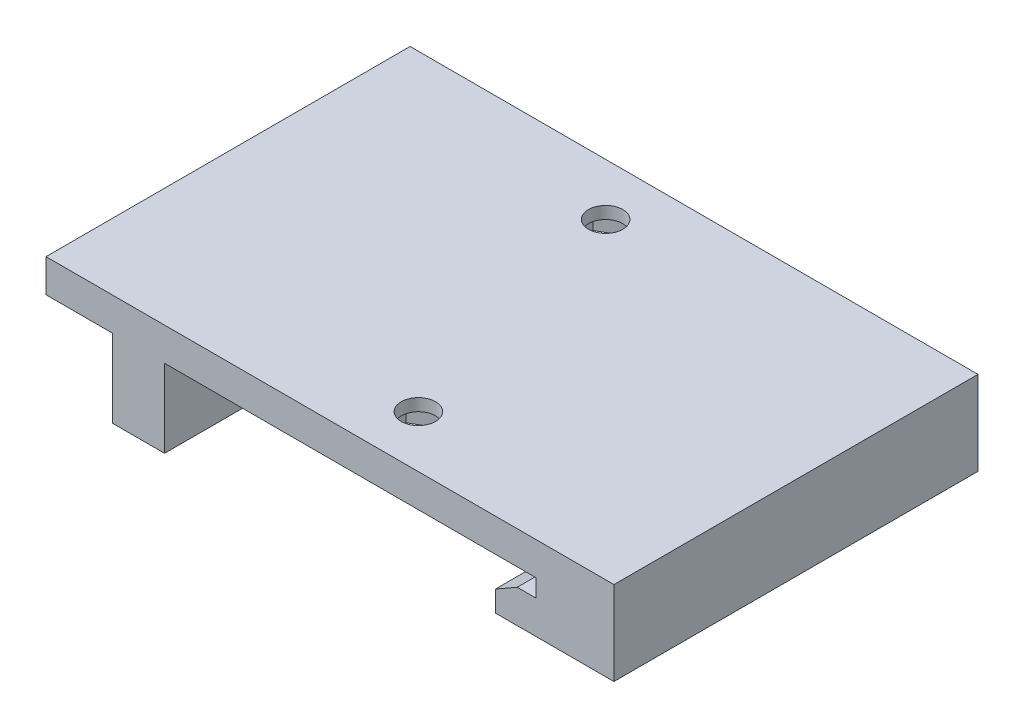
ISO-10303-21;
HEADER;
FILE_DESCRIPTION(('STEP AP214'),'2;1');
FILE_NAME('part.step','',(''),(''),'','','');
FILE_SCHEMA(('AUTOMOTIVE_DESIGN { 1 0 10303 214 1 1 1 1 }'));
ENDSEC;
DATA;
#1=APPLICATION_CONTEXT('core data for automotive mechanical design processes');
#2=APPLICATION_PROTOCOL_DEFINITION('international standard','automotive_design',2000,#1);
#3=PRODUCT_CONTEXT('',#1,'mechanical');
#4=PRODUCT('Part','Part','',(#3));
#5=PRODUCT_RELATED_PRODUCT_CATEGORY('part','',(#4));
#6=PRODUCT_DEFINITION_FORMATION('','',#4);
#7=PRODUCT_DEFINITION_CONTEXT('part definition',#1,'design');
#8=PRODUCT_DEFINITION('design','',#6,#7);
#9=PRODUCT_DEFINITION_SHAPE('','',#8);
#10=(LENGTH_UNIT() NAMED_UNIT(*) SI_UNIT(.MILLI.,.METRE.));
#11=(NAMED_UNIT(*) PLANE_ANGLE_UNIT() SI_UNIT($,.RADIAN.));
#12=(NAMED_UNIT(*) SI_UNIT($,.STERADIAN.) SOLID_ANGLE_UNIT());
#13=UNCERTAINTY_MEASURE_WITH_UNIT(LENGTH_MEASURE(1.E-05),#10,'distance_accuracy_value','');
#14=(GEOMETRIC_REPRESENTATION_CONTEXT(3) GLOBAL_UNCERTAINTY_ASSIGNED_CONTEXT((#13)) GLOBAL_UNIT_ASSIGNED_CONTEXT((#10,
#11,#12)) REPRESENTATION_CONTEXT('',''));
#15=CARTESIAN_POINT('',(0.,0.,0.));
#16=DIRECTION('',(0.,0.,1.));
#17=DIRECTION('',(1.,0.,0.));
#18=AXIS2_PLACEMENT_3D('',#15,#16,#17);
#19=CARTESIAN_POINT('',(0.,0.,35.));
#20=DIRECTION('',(0.,1.,0.));
#21=DIRECTION('',(0.,0.,1.));
#22=AXIS2_PLACEMENT_3D('',#19,#20,#21);
#23=PLANE('',#22);
#24=DIRECTION('',(0.,0.,1.));
#25=VECTOR('',#24,1.);
#26=CARTESIAN_POINT('',(6.35,0.,28.3545517328096));
#27=LINE('',#26,#25);
#28=CARTESIAN_POINT('',(6.35,0.,28.3545517328096));
#29=VERTEX_POINT('',#28);
#30=CARTESIAN_POINT('',(6.35,0.,31.6454482671904));
#31=VERTEX_POINT('',#30);
#32=EDGE_CURVE('E259',#29,#31,#27,.T.);
#33=ORIENTED_EDGE('',*,*,#32,.F.);
#34=DIRECTION('',(0.866025403784439,0.,0.5));
#35=VECTOR('',#34,1.);
#36=CARTESIAN_POINT('',(3.5,0.,26.7091034656191));
#37=LINE('',#36,#35);
#38=CARTESIAN_POINT('',(3.5,0.,26.7091034656191));
#39=VERTEX_POINT('',#38);
#40=EDGE_CURVE('E60',#39,#29,#37,.T.);
#41=ORIENTED_EDGE('',*,*,#40,.F.);
#42=DIRECTION('',(0.866025403784438,0.,-0.500000000000001));
#43=VECTOR('',#42,1.);
#44=CARTESIAN_POINT('',(0.649999999999999,0.,28.3545517328096));
#45=LINE('',#44,#43);
#46=CARTESIAN_POINT('',(0.649999999999999,0.,28.3545517328096));
#47=VERTEX_POINT('',#46);
#48=EDGE_CURVE('E236',#47,#39,#45,.T.);
#49=ORIENTED_EDGE('',*,*,#48,.F.);
#50=DIRECTION('',(0.,0.,-1.));
#51=VECTOR('',#50,1.);
#52=CARTESIAN_POINT('',(0.649999999999999,0.,31.6454482671904));
#53=LINE('',#52,#51);
#54=CARTESIAN_POINT('',(0.649999999999999,0.,31.6454482671904));
#55=VERTEX_POINT('',#54);
#56=EDGE_CURVE('E240',#55,#47,#53,.T.);
#57=ORIENTED_EDGE('',*,*,#56,.F.);
#58=DIRECTION('',(-0.866025403784439,0.,-0.499999999999999));
#59=VECTOR('',#58,1.);
#60=CARTESIAN_POINT('',(3.5,0.,33.2908965343809));
#61=LINE('',#60,#59);
#62=CARTESIAN_POINT('',(3.5,0.,33.2908965343809));
#63=VERTEX_POINT('',#62);
#64=EDGE_CURVE('E266',#63,#55,#61,.T.);
#65=ORIENTED_EDGE('',*,*,#64,.F.);
#66=DIRECTION('',(-0.866025403784439,0.,0.5));
#67=VECTOR('',#66,1.);
#68=CARTESIAN_POINT('',(6.35,0.,31.6454482671904));
#69=LINE('',#68,#67);
#70=EDGE_CURVE('E262',#31,#63,#69,.T.);
#71=ORIENTED_EDGE('',*,*,#70,.F.);
#72=EDGE_LOOP('',(#33,#41,#49,#57,#65,#71));
#73=FACE_BOUND('',#72,.T.);
#74=DIRECTION('',(-0.866025403784439,0.,0.5));
#75=VECTOR('',#74,1.);
#76=CARTESIAN_POINT('',(-0.649999999999998,0.,6.64544826719043));
#77=LINE('',#76,#75);
#78=CARTESIAN_POINT('',(-0.649999999999998,0.,6.64544826719044));
#79=VERTEX_POINT('',#78);
#80=CARTESIAN_POINT('',(-3.5,0.,8.29089653438087));
#81=VERTEX_POINT('',#80);
#82=EDGE_CURVE('E324',#79,#81,#77,.T.);
#83=ORIENTED_EDGE('',*,*,#82,.F.);
#84=DIRECTION('',(0.,0.,1.));
#85=VECTOR('',#84,1.);
#86=CARTESIAN_POINT('',(-0.649999999999997,0.,3.35455173280957));
#87=LINE('',#86,#85);
#88=CARTESIAN_POINT('',(-0.649999999999997,0.,3.35455173280957));
#89=VERTEX_POINT('',#88);
#90=EDGE_CURVE('E68',#89,#79,#87,.T.);
#91=ORIENTED_EDGE('',*,*,#90,.F.);
#92=DIRECTION('',(0.866025403784438,0.,0.5));
#93=VECTOR('',#92,1.);
#94=CARTESIAN_POINT('',(-3.5,0.,1.70910346561913));
#95=LINE('',#94,#93);
#96=CARTESIAN_POINT('',(-3.5,0.,1.70910346561913));
#97=VERTEX_POINT('',#96);
#98=EDGE_CURVE('E307',#97,#89,#95,.T.);
#99=ORIENTED_EDGE('',*,*,#98,.F.);
#100=DIRECTION('',(0.866025403784439,0.,-0.5));
#101=VECTOR('',#100,1.);
#102=CARTESIAN_POINT('',(-6.35,0.,3.35455173280956));
#103=LINE('',#102,#101);
#104=CARTESIAN_POINT('',(-6.35,0.,3.35455173280956));
#105=VERTEX_POINT('',#104);
#106=EDGE_CURVE('E311',#105,#97,#103,.T.);
#107=ORIENTED_EDGE('',*,*,#106,.F.);
#108=DIRECTION('',(0.,0.,-1.));
#109=VECTOR('',#108,1.);
#110=CARTESIAN_POINT('',(-6.35,0.,6.64544826719043));
#111=LINE('',#110,#109);
#112=CARTESIAN_POINT('',(-6.35,0.,6.64544826719043));
#113=VERTEX_POINT('',#112);
#114=EDGE_CURVE('E316',#113,#105,#111,.T.);
#115=ORIENTED_EDGE('',*,*,#114,.F.);
#116=DIRECTION('',(-0.866025403784438,0.,-0.5));
#117=VECTOR('',#116,1.);
#118=CARTESIAN_POINT('',(-3.5,0.,8.29089653438087));
#119=LINE('',#118,#117);
#120=EDGE_CURVE('E320',#81,#113,#119,.T.);
#121=ORIENTED_EDGE('',*,*,#120,.F.);
#122=EDGE_LOOP('',(#83,#91,#99,#107,#115,#121));
#123=FACE_BOUND('',#122,.T.);
#124=DIRECTION('',(1.,0.,0.));
#125=VECTOR('',#124,1.);
#126=CARTESIAN_POINT('',(0.,0.,0.));
#127=LINE('',#126,#125);
#128=CARTESIAN_POINT('',(-15.9,0.,0.));
#129=VERTEX_POINT('',#128);
#130=CARTESIAN_POINT('',(19.8,0.,0.));
#131=VERTEX_POINT('',#130);
#132=EDGE_CURVE('E361',#129,#131,#127,.T.);
#133=ORIENTED_EDGE('',*,*,#132,.T.);
#134=DIRECTION('',(0.,0.,-1.));
#135=VECTOR('',#134,1.);
#136=CARTESIAN_POINT('',(19.8,0.,35.));
#137=LINE('',#136,#135);
#138=CARTESIAN_POINT('',(19.8,0.,35.));
#139=VERTEX_POINT('',#138);
#140=EDGE_CURVE('E11',#139,#131,#137,.T.);
#141=ORIENTED_EDGE('',*,*,#140,.F.);
#142=DIRECTION('',(1.,0.,0.));
#143=VECTOR('',#142,1.);
#144=CARTESIAN_POINT('',(-15.9,0.,35.));
#145=LINE('',#144,#143);
#146=CARTESIAN_POINT('',(-15.9,0.,35.));
#147=VERTEX_POINT('',#146);
#148=EDGE_CURVE('E368',#147,#139,#145,.T.);
#149=ORIENTED_EDGE('',*,*,#148,.F.);
#150=DIRECTION('',(0.,0.,-1.));
#151=VECTOR('',#150,1.);
#152=CARTESIAN_POINT('',(-15.9,0.,35.));
#153=LINE('',#152,#151);
#154=EDGE_CURVE('E408',#147,#129,#153,.T.);
#155=ORIENTED_EDGE('',*,*,#154,.T.);
#156=EDGE_LOOP('',(#133,#141,#149,#155));
#157=FACE_BOUND('',#156,.T.);
#158=ADVANCED_FACE('F45',(#73,#123,#157),#23,.F.);
#159=CARTESIAN_POINT('',(19.8,0.,35.));
#160=DIRECTION('',(1.,0.,0.));
#161=DIRECTION('',(0.,0.,-1.));
#162=AXIS2_PLACEMENT_3D('',#159,#160,#161);
#163=PLANE('',#162);
#164=DIRECTION('',(0.,-1.,0.));
#165=VECTOR('',#164,1.);
#166=CARTESIAN_POINT('',(19.8,0.,0.));
#167=LINE('',#166,#165);
#168=CARTESIAN_POINT('',(19.8,-1.7,0.));
#169=VERTEX_POINT('',#168);
#170=EDGE_CURVE('E411',#131,#169,#167,.T.);
#171=ORIENTED_EDGE('',*,*,#170,.T.);
#172=DIRECTION('',(0.,0.,-1.));
#173=VECTOR('',#172,1.);
#174=CARTESIAN_POINT('',(19.8,-1.7,35.));
#175=LINE('',#174,#173);
#176=CARTESIAN_POINT('',(19.8,-1.7,35.));
#177=VERTEX_POINT('',#176);
#178=EDGE_CURVE('E53',#177,#169,#175,.T.);
#179=ORIENTED_EDGE('',*,*,#178,.F.);
#180=DIRECTION('',(0.,-1.,0.));
#181=VECTOR('',#180,1.);
#182=CARTESIAN_POINT('',(19.8,0.,35.));
#183=LINE('',#182,#181);
#184=EDGE_CURVE('E371',#139,#177,#183,.T.);
#185=ORIENTED_EDGE('',*,*,#184,.F.);
#186=ORIENTED_EDGE('',*,*,#140,.T.);
#187=EDGE_LOOP('',(#171,#179,#185,#186));
#188=FACE_BOUND('',#187,.T.);
#189=ADVANCED_FACE('F519',(#188),#163,.F.);
#190=CARTESIAN_POINT('',(19.8,-1.7,35.));
#191=DIRECTION('',(0.,-1.,0.));
#192=DIRECTION('',(1.,0.,0.));
#193=AXIS2_PLACEMENT_3D('',#190,#191,#192);
#194=PLANE('',#193);
#195=DIRECTION('',(-1.,0.,0.));
#196=VECTOR('',#195,1.);
#197=CARTESIAN_POINT('',(19.8,-1.7,0.));
#198=LINE('',#197,#196);
#199=CARTESIAN_POINT('',(18.,-1.7,0.));
#200=VERTEX_POINT('',#199);
#201=EDGE_CURVE('E414',#169,#200,#198,.T.);
#202=ORIENTED_EDGE('',*,*,#201,.T.);
#203=DIRECTION('',(0.,0.,-1.));
#204=VECTOR('',#203,1.);
#205=CARTESIAN_POINT('',(18.,-1.7,35.));
#206=LINE('',#205,#204);
#207=CARTESIAN_POINT('',(18.,-1.7,35.));
#208=VERTEX_POINT('',#207);
#209=EDGE_CURVE('E486',#208,#200,#206,.T.);
#210=ORIENTED_EDGE('',*,*,#209,.F.);
#211=DIRECTION('',(-1.,0.,0.));
#212=VECTOR('',#211,1.);
#213=CARTESIAN_POINT('',(19.8,-1.7,35.));
#214=LINE('',#213,#212);
#215=EDGE_CURVE('E375',#177,#208,#214,.T.);
#216=ORIENTED_EDGE('',*,*,#215,.F.);
#217=ORIENTED_EDGE('',*,*,#178,.T.);
#218=EDGE_LOOP('',(#202,#210,#216,#217));
#219=FACE_BOUND('',#218,.T.);
#220=ADVANCED_FACE('F495',(#219),#194,.F.);
#221=CARTESIAN_POINT('',(18.,-1.7,35.));
#222=DIRECTION('',(0.496138938356833,-0.868243142124459,0.));
#223=DIRECTION('',(0.868243142124459,0.496138938356833,0.));
#224=AXIS2_PLACEMENT_3D('',#221,#222,#223);
#225=PLANE('',#224);
#226=DIRECTION('',(-0.868243142124459,-0.496138938356834,0.));
#227=VECTOR('',#226,1.);
#228=CARTESIAN_POINT('',(18.,-1.7,0.));
#229=LINE('',#228,#227);
#230=CARTESIAN_POINT('',(15.9,-2.9,0.));
#231=VERTEX_POINT('',#230);
#232=EDGE_CURVE('E417',#200,#231,#229,.T.);
#233=ORIENTED_EDGE('',*,*,#232,.T.);
#234=DIRECTION('',(0.,0.,-1.));
#235=VECTOR('',#234,1.);
#236=CARTESIAN_POINT('',(15.9,-2.9,35.));
#237=LINE('',#236,#235);
#238=CARTESIAN_POINT('',(15.9,-2.9,35.));
#239=VERTEX_POINT('',#238);
#240=EDGE_CURVE('E482',#239,#231,#237,.T.);
#241=ORIENTED_EDGE('',*,*,#240,.F.);
#242=DIRECTION('',(-0.868243142124459,-0.496138938356834,0.));
#243=VECTOR('',#242,1.);
#244=CARTESIAN_POINT('',(18.,-1.7,35.));
#245=LINE('',#244,#243);
#246=EDGE_CURVE('E378',#208,#239,#245,.T.);
#247=ORIENTED_EDGE('',*,*,#246,.F.);
#248=ORIENTED_EDGE('',*,*,#209,.T.);
#249=EDGE_LOOP('',(#233,#241,#247,#248));
#250=FACE_BOUND('',#249,.T.);
#251=ADVANCED_FACE('F507',(#250),#225,.F.);
#252=CARTESIAN_POINT('',(15.9,-2.9,35.));
#253=DIRECTION('',(1.,0.,0.));
#254=DIRECTION('',(0.,0.,-1.));
#255=AXIS2_PLACEMENT_3D('',#252,#253,#254);
#256=PLANE('',#255);
#257=DIRECTION('',(0.,-1.,0.));
#258=VECTOR('',#257,1.);
#259=CARTESIAN_POINT('',(15.9,-2.9,0.));
#260=LINE('',#259,#258);
#261=CARTESIAN_POINT('',(15.9,-4.9,0.));
#262=VERTEX_POINT('',#261);
#263=EDGE_CURVE('E420',#231,#262,#260,.T.);
#264=ORIENTED_EDGE('',*,*,#263,.T.);
#265=DIRECTION('',(0.,0.,-1.));
#266=VECTOR('',#265,1.);
#267=CARTESIAN_POINT('',(15.9,-4.9,35.));
#268=LINE('',#267,#266);
#269=CARTESIAN_POINT('',(15.9,-4.9,35.));
#270=VERTEX_POINT('',#269);
#271=EDGE_CURVE('E478',#270,#262,#268,.T.);
#272=ORIENTED_EDGE('',*,*,#271,.F.);
#273=DIRECTION('',(0.,-1.,0.));
#274=VECTOR('',#273,1.);
#275=CARTESIAN_POINT('',(15.9,-2.9,35.));
#276=LINE('',#275,#274);
#277=EDGE_CURVE('E381',#239,#270,#276,.T.);
#278=ORIENTED_EDGE('',*,*,#277,.F.);
#279=ORIENTED_EDGE('',*,*,#240,.T.);
#280=EDGE_LOOP('',(#264,#272,#278,#279));
#281=FACE_BOUND('',#280,.T.);
#282=ADVANCED_FACE('F511',(#281),#256,.F.);
#283=CARTESIAN_POINT('',(15.9,-4.9,35.));
#284=DIRECTION('',(0.,1.,0.));
#285=DIRECTION('',(-1.,0.,0.));
#286=AXIS2_PLACEMENT_3D('',#283,#284,#285);
#287=PLANE('',#286);
#288=DIRECTION('',(1.,0.,0.));
#289=VECTOR('',#288,1.);
#290=CARTESIAN_POINT('',(15.9,-4.9,0.));
#291=LINE('',#290,#289);
#292=CARTESIAN_POINT('',(27.3,-4.9,0.));
#293=VERTEX_POINT('',#292);
#294=EDGE_CURVE('E423',#262,#293,#291,.T.);
#295=ORIENTED_EDGE('',*,*,#294,.T.);
#296=DIRECTION('',(0.,0.,-1.));
#297=VECTOR('',#296,1.);
#298=CARTESIAN_POINT('',(27.3,-4.9,35.));
#299=LINE('',#298,#297);
#300=CARTESIAN_POINT('',(27.3,-4.9,35.));
#301=VERTEX_POINT('',#300);
#302=EDGE_CURVE('E474',#301,#293,#299,.T.);
#303=ORIENTED_EDGE('',*,*,#302,.F.);
#304=DIRECTION('',(1.,0.,0.));
#305=VECTOR('',#304,1.);
#306=CARTESIAN_POINT('',(15.9,-4.9,35.));
#307=LINE('',#306,#305);
#308=EDGE_CURVE('E384',#270,#301,#307,.T.);
#309=ORIENTED_EDGE('',*,*,#308,.F.);
#310=ORIENTED_EDGE('',*,*,#271,.T.);
#311=EDGE_LOOP('',(#295,#303,#309,#310));
#312=FACE_BOUND('',#311,.T.);
#313=ADVANCED_FACE('F557',(#312),#287,.F.);
#314=CARTESIAN_POINT('',(27.3,3.17499999999999,35.));
#315=DIRECTION('',(-1.,0.,0.));
#316=DIRECTION('',(0.,0.,1.));
#317=AXIS2_PLACEMENT_3D('',#314,#315,#316);
#318=PLANE('',#317);
#319=DIRECTION('',(0.,1.,0.));
#320=VECTOR('',#319,1.);
#321=CARTESIAN_POINT('',(27.3,3.17499999999999,0.));
#322=LINE('',#321,#320);
#323=CARTESIAN_POINT('',(27.3,3.17499999999999,0.));
#324=VERTEX_POINT('',#323);
#325=EDGE_CURVE('E426',#293,#324,#322,.T.);
#326=ORIENTED_EDGE('',*,*,#325,.T.);
#327=DIRECTION('',(0.,0.,-1.));
#328=VECTOR('',#327,1.);
#329=CARTESIAN_POINT('',(27.3,3.17499999999999,35.));
#330=LINE('',#329,#328);
#331=CARTESIAN_POINT('',(27.3,3.17499999999999,35.));
#332=VERTEX_POINT('',#331);
#333=EDGE_CURVE('E470',#332,#324,#330,.T.);
#334=ORIENTED_EDGE('',*,*,#333,.F.);
#335=DIRECTION('',(0.,1.,0.));
#336=VECTOR('',#335,1.);
#337=CARTESIAN_POINT('',(27.3,3.17499999999999,35.));
#338=LINE('',#337,#336);
#339=EDGE_CURVE('E387',#301,#332,#338,.T.);
#340=ORIENTED_EDGE('',*,*,#339,.F.);
#341=ORIENTED_EDGE('',*,*,#302,.T.);
#342=EDGE_LOOP('',(#326,#334,#340,#341));
#343=FACE_BOUND('',#342,.T.);
#344=ADVANCED_FACE('F555',(#343),#318,.F.);
#345=CARTESIAN_POINT('',(27.3,3.17499999999999,35.));
#346=DIRECTION('',(0.,-1.,0.));
#347=DIRECTION('',(0.,0.,-1.));
#348=AXIS2_PLACEMENT_3D('',#345,#346,#347);
#349=PLANE('',#348);
#350=CARTESIAN_POINT('',(3.5,3.17499999999999,30.));
#351=DIRECTION('',(0.,-1.,0.));
#352=DIRECTION('',(0.,0.,-1.));
#353=AXIS2_PLACEMENT_3D('',#350,#351,#352);
#354=CIRCLE('',#353,1.65);
#355=CARTESIAN_POINT('',(3.5,3.17499999999999,28.35));
#356=VERTEX_POINT('',#355);
#357=EDGE_CURVE('E645',#356,#356,#354,.T.);
#358=ORIENTED_EDGE('',*,*,#357,.T.);
#359=EDGE_LOOP('',(#358));
#360=FACE_BOUND('',#359,.T.);
#361=CARTESIAN_POINT('',(-3.5,3.17499999999999,5.));
#362=DIRECTION('',(0.,-1.,0.));
#363=DIRECTION('',(0.,0.,-1.));
#364=AXIS2_PLACEMENT_3D('',#361,#362,#363);
#365=CIRCLE('',#364,1.65);
#366=CARTESIAN_POINT('',(-3.5,3.17499999999999,3.35));
#367=VERTEX_POINT('',#366);
#368=EDGE_CURVE('E648',#367,#367,#365,.T.);
#369=ORIENTED_EDGE('',*,*,#368,.T.);
#370=EDGE_LOOP('',(#369));
#371=FACE_BOUND('',#370,.T.);
#372=DIRECTION('',(-1.,0.,0.));
#373=VECTOR('',#372,1.);
#374=CARTESIAN_POINT('',(27.3,3.17499999999999,0.));
#375=LINE('',#374,#373);
#376=CARTESIAN_POINT('',(-27.3,3.17499999999999,0.));
#377=VERTEX_POINT('',#376);
#378=EDGE_CURVE('E429',#324,#377,#375,.T.);
#379=ORIENTED_EDGE('',*,*,#378,.T.);
#380=DIRECTION('',(0.,0.,-1.));
#381=VECTOR('',#380,1.);
#382=CARTESIAN_POINT('',(-27.3,3.17499999999999,35.));
#383=LINE('',#382,#381);
#384=CARTESIAN_POINT('',(-27.3,3.17499999999999,35.));
#385=VERTEX_POINT('',#384);
#386=EDGE_CURVE('E466',#385,#377,#383,.T.);
#387=ORIENTED_EDGE('',*,*,#386,.F.);
#388=DIRECTION('',(-1.,0.,0.));
#389=VECTOR('',#388,1.);
#390=CARTESIAN_POINT('',(27.3,3.17499999999999,35.));
#391=LINE('',#390,#389);
#392=EDGE_CURVE('E390',#332,#385,#391,.T.);
#393=ORIENTED_EDGE('',*,*,#392,.F.);
#394=ORIENTED_EDGE('',*,*,#333,.T.);
#395=EDGE_LOOP('',(#379,#387,#393,#394));
#396=FACE_BOUND('',#395,.T.);
#397=ADVANCED_FACE('F550',(#360,#371,#396),#349,.F.);
#398=CARTESIAN_POINT('',(-27.3,3.17499999999999,35.));
#399=DIRECTION('',(1.,0.,0.));
#400=DIRECTION('',(0.,0.,-1.));
#401=AXIS2_PLACEMENT_3D('',#398,#399,#400);
#402=PLANE('',#401);
#403=DIRECTION('',(0.,-1.,0.));
#404=VECTOR('',#403,1.);
#405=CARTESIAN_POINT('',(-27.3,3.17499999999999,0.));
#406=LINE('',#405,#404);
#407=CARTESIAN_POINT('',(-27.3,0.,0.));
#408=VERTEX_POINT('',#407);
#409=EDGE_CURVE('E432',#377,#408,#406,.T.);
#410=ORIENTED_EDGE('',*,*,#409,.T.);
#411=DIRECTION('',(0.,0.,-1.));
#412=VECTOR('',#411,1.);
#413=CARTESIAN_POINT('',(-27.3,0.,35.));
#414=LINE('',#413,#412);
#415=CARTESIAN_POINT('',(-27.3,0.,35.));
#416=VERTEX_POINT('',#415);
#417=EDGE_CURVE('E462',#416,#408,#414,.T.);
#418=ORIENTED_EDGE('',*,*,#417,.F.);
#419=DIRECTION('',(0.,-1.,0.));
#420=VECTOR('',#419,1.);
#421=CARTESIAN_POINT('',(-27.3,3.17499999999999,35.));
#422=LINE('',#421,#420);
#423=EDGE_CURVE('E393',#385,#416,#422,.T.);
#424=ORIENTED_EDGE('',*,*,#423,.F.);
#425=ORIENTED_EDGE('',*,*,#386,.T.);
#426=EDGE_LOOP('',(#410,#418,#424,#425));
#427=FACE_BOUND('',#426,.T.);
#428=ADVANCED_FACE('F545',(#427),#402,.F.);
#429=CARTESIAN_POINT('',(-27.3,0.,35.));
#430=DIRECTION('',(0.,1.,0.));
#431=DIRECTION('',(-1.,0.,0.));
#432=AXIS2_PLACEMENT_3D('',#429,#430,#431);
#433=PLANE('',#432);
#434=DIRECTION('',(1.,0.,0.));
#435=VECTOR('',#434,1.);
#436=CARTESIAN_POINT('',(-27.3,0.,0.));
#437=LINE('',#436,#435);
#438=CARTESIAN_POINT('',(-20.9,0.,0.));
#439=VERTEX_POINT('',#438);
#440=EDGE_CURVE('E435',#408,#439,#437,.T.);
#441=ORIENTED_EDGE('',*,*,#440,.T.);
#442=DIRECTION('',(0.,0.,-1.));
#443=VECTOR('',#442,1.);
#444=CARTESIAN_POINT('',(-20.9,0.,35.));
#445=LINE('',#444,#443);
#446=CARTESIAN_POINT('',(-20.9,0.,35.));
#447=VERTEX_POINT('',#446);
#448=EDGE_CURVE('E458',#447,#439,#445,.T.);
#449=ORIENTED_EDGE('',*,*,#448,.F.);
#450=DIRECTION('',(1.,0.,0.));
#451=VECTOR('',#450,1.);
#452=CARTESIAN_POINT('',(-27.3,0.,35.));
#453=LINE('',#452,#451);
#454=EDGE_CURVE('E396',#416,#447,#453,.T.);
#455=ORIENTED_EDGE('',*,*,#454,.F.);
#456=ORIENTED_EDGE('',*,*,#417,.T.);
#457=EDGE_LOOP('',(#441,#449,#455,#456));
#458=FACE_BOUND('',#457,.T.);
#459=ADVANCED_FACE('F541',(#458),#433,.F.);
#460=CARTESIAN_POINT('',(-20.9,0.,35.));
#461=DIRECTION('',(1.,0.,0.));
#462=DIRECTION('',(0.,0.,-1.));
#463=AXIS2_PLACEMENT_3D('',#460,#461,#462);
#464=PLANE('',#463);
#465=CARTESIAN_POINT('',(-20.9,-3.75,8.75));
#466=DIRECTION('',(-1.,0.,0.));
#467=DIRECTION('',(0.,0.,1.));
#468=AXIS2_PLACEMENT_3D('',#465,#466,#467);
#469=CIRCLE('',#468,1.275);
#470=CARTESIAN_POINT('',(-20.9,-3.75,10.025));
#471=VERTEX_POINT('',#470);
#472=EDGE_CURVE('E352',#471,#471,#469,.T.);
#473=ORIENTED_EDGE('',*,*,#472,.F.);
#474=EDGE_LOOP('',(#473));
#475=FACE_BOUND('',#474,.T.);
#476=CARTESIAN_POINT('',(-20.9,-3.75,26.25));
#477=DIRECTION('',(-1.,0.,0.));
#478=DIRECTION('',(0.,0.,1.));
#479=AXIS2_PLACEMENT_3D('',#476,#477,#478);
#480=CIRCLE('',#479,1.275);
#481=CARTESIAN_POINT('',(-20.9,-3.75,27.525));
#482=VERTEX_POINT('',#481);
#483=EDGE_CURVE('E357',#482,#482,#480,.T.);
#484=ORIENTED_EDGE('',*,*,#483,.F.);
#485=EDGE_LOOP('',(#484));
#486=FACE_BOUND('',#485,.T.);
#487=DIRECTION('',(0.,-1.,0.));
#488=VECTOR('',#487,1.);
#489=CARTESIAN_POINT('',(-20.9,0.,0.));
#490=LINE('',#489,#488);
#491=CARTESIAN_POINT('',(-20.9,-7.5,0.));
#492=VERTEX_POINT('',#491);
#493=EDGE_CURVE('E438',#439,#492,#490,.T.);
#494=ORIENTED_EDGE('',*,*,#493,.T.);
#495=DIRECTION('',(0.,0.,-1.));
#496=VECTOR('',#495,1.);
#497=CARTESIAN_POINT('',(-20.9,-7.5,35.));
#498=LINE('',#497,#496);
#499=CARTESIAN_POINT('',(-20.9,-7.5,35.));
#500=VERTEX_POINT('',#499);
#501=EDGE_CURVE('E454',#500,#492,#498,.T.);
#502=ORIENTED_EDGE('',*,*,#501,.F.);
#503=DIRECTION('',(0.,-1.,0.));
#504=VECTOR('',#503,1.);
#505=CARTESIAN_POINT('',(-20.9,0.,35.));
#506=LINE('',#505,#504);
#507=EDGE_CURVE('E399',#447,#500,#506,.T.);
#508=ORIENTED_EDGE('',*,*,#507,.F.);
#509=ORIENTED_EDGE('',*,*,#448,.T.);
#510=EDGE_LOOP('',(#494,#502,#508,#509));
#511=FACE_BOUND('',#510,.T.);
#512=ADVANCED_FACE('F536',(#475,#486,#511),#464,.F.);
#513=CARTESIAN_POINT('',(-20.9,-7.5,35.));
#514=DIRECTION('',(0.,1.,0.));
#515=DIRECTION('',(0.,0.,1.));
#516=AXIS2_PLACEMENT_3D('',#513,#514,#515);
#517=PLANE('',#516);
#518=DIRECTION('',(1.,0.,0.));
#519=VECTOR('',#518,1.);
#520=CARTESIAN_POINT('',(-20.9,-7.5,0.));
#521=LINE('',#520,#519);
#522=CARTESIAN_POINT('',(-15.9,-7.5,0.));
#523=VERTEX_POINT('',#522);
#524=EDGE_CURVE('E441',#492,#523,#521,.T.);
#525=ORIENTED_EDGE('',*,*,#524,.T.);
#526=DIRECTION('',(0.,0.,-1.));
#527=VECTOR('',#526,1.);
#528=CARTESIAN_POINT('',(-15.9,-7.5,35.));
#529=LINE('',#528,#527);
#530=CARTESIAN_POINT('',(-15.9,-7.5,35.));
#531=VERTEX_POINT('',#530);
#532=EDGE_CURVE('E450',#531,#523,#529,.T.);
#533=ORIENTED_EDGE('',*,*,#532,.F.);
#534=DIRECTION('',(1.,0.,0.));
#535=VECTOR('',#534,1.);
#536=CARTESIAN_POINT('',(-20.9,-7.5,35.));
#537=LINE('',#536,#535);
#538=EDGE_CURVE('E402',#500,#531,#537,.T.);
#539=ORIENTED_EDGE('',*,*,#538,.F.);
#540=ORIENTED_EDGE('',*,*,#501,.T.);
#541=EDGE_LOOP('',(#525,#533,#539,#540));
#542=FACE_BOUND('',#541,.T.);
#543=ADVANCED_FACE('F530',(#542),#517,.F.);
#544=CARTESIAN_POINT('',(-15.9,-7.5,35.));
#545=DIRECTION('',(-1.,0.,0.));
#546=DIRECTION('',(0.,0.,1.));
#547=AXIS2_PLACEMENT_3D('',#544,#545,#546);
#548=PLANE('',#547);
#549=CARTESIAN_POINT('',(-15.9,-3.75,8.75));
#550=DIRECTION('',(-1.,0.,0.));
#551=DIRECTION('',(0.,0.,1.));
#552=AXIS2_PLACEMENT_3D('',#549,#550,#551);
#553=CIRCLE('',#552,1.275);
#554=CARTESIAN_POINT('',(-15.9,-3.75,10.025));
#555=VERTEX_POINT('',#554);
#556=EDGE_CURVE('E356',#555,#555,#553,.F.);
#557=ORIENTED_EDGE('',*,*,#556,.F.);
#558=EDGE_LOOP('',(#557));
#559=FACE_BOUND('',#558,.T.);
#560=CARTESIAN_POINT('',(-15.9,-3.75,26.25));
#561=DIRECTION('',(-1.,0.,0.));
#562=DIRECTION('',(0.,0.,1.));
#563=AXIS2_PLACEMENT_3D('',#560,#561,#562);
#564=CIRCLE('',#563,1.275);
#565=CARTESIAN_POINT('',(-15.9,-3.75,27.525));
#566=VERTEX_POINT('',#565);
#567=EDGE_CURVE('E276',#566,#566,#564,.F.);
#568=ORIENTED_EDGE('',*,*,#567,.F.);
#569=EDGE_LOOP('',(#568));
#570=FACE_BOUND('',#569,.T.);
#571=DIRECTION('',(0.,1.,0.));
#572=VECTOR('',#571,1.);
#573=CARTESIAN_POINT('',(-15.9,-7.5,0.));
#574=LINE('',#573,#572);
#575=EDGE_CURVE('E372',#523,#129,#574,.T.);
#576=ORIENTED_EDGE('',*,*,#575,.T.);
#577=ORIENTED_EDGE('',*,*,#154,.F.);
#578=DIRECTION('',(0.,1.,0.));
#579=VECTOR('',#578,1.);
#580=CARTESIAN_POINT('',(-15.9,-7.5,35.));
#581=LINE('',#580,#579);
#582=EDGE_CURVE('E405',#531,#147,#581,.T.);
#583=ORIENTED_EDGE('',*,*,#582,.F.);
#584=ORIENTED_EDGE('',*,*,#532,.T.);
#585=EDGE_LOOP('',(#576,#577,#583,#584));
#586=FACE_BOUND('',#585,.T.);
#587=ADVANCED_FACE('F525',(#559,#570,#586),#548,.F.);
#588=CARTESIAN_POINT('',(0.,0.,35.));
#589=DIRECTION('',(0.,0.,-1.));
#590=DIRECTION('',(-1.,0.,0.));
#591=AXIS2_PLACEMENT_3D('',#588,#589,#590);
#592=PLANE('',#591);
#593=ORIENTED_EDGE('',*,*,#148,.T.);
#594=ORIENTED_EDGE('',*,*,#184,.T.);
#595=ORIENTED_EDGE('',*,*,#215,.T.);
#596=ORIENTED_EDGE('',*,*,#246,.T.);
#597=ORIENTED_EDGE('',*,*,#277,.T.);
#598=ORIENTED_EDGE('',*,*,#308,.T.);
#599=ORIENTED_EDGE('',*,*,#339,.T.);
#600=ORIENTED_EDGE('',*,*,#392,.T.);
#601=ORIENTED_EDGE('',*,*,#423,.T.);
#602=ORIENTED_EDGE('',*,*,#454,.T.);
#603=ORIENTED_EDGE('',*,*,#507,.T.);
#604=ORIENTED_EDGE('',*,*,#538,.T.);
#605=ORIENTED_EDGE('',*,*,#582,.T.);
#606=EDGE_LOOP('',(#593,#594,#595,#596,#597,#598,#599,#600,#601,#602,#603,#604,#605));
#607=FACE_BOUND('',#606,.T.);
#608=ADVANCED_FACE('F515',(#607),#592,.F.);
#609=CARTESIAN_POINT('',(0.,0.,0.));
#610=DIRECTION('',(0.,0.,-1.));
#611=DIRECTION('',(-1.,0.,0.));
#612=AXIS2_PLACEMENT_3D('',#609,#610,#611);
#613=PLANE('',#612);
#614=ORIENTED_EDGE('',*,*,#132,.F.);
#615=ORIENTED_EDGE('',*,*,#575,.F.);
#616=ORIENTED_EDGE('',*,*,#524,.F.);
#617=ORIENTED_EDGE('',*,*,#493,.F.);
#618=ORIENTED_EDGE('',*,*,#440,.F.);
#619=ORIENTED_EDGE('',*,*,#409,.F.);
#620=ORIENTED_EDGE('',*,*,#378,.F.);
#621=ORIENTED_EDGE('',*,*,#325,.F.);
#622=ORIENTED_EDGE('',*,*,#294,.F.);
#623=ORIENTED_EDGE('',*,*,#263,.F.);
#624=ORIENTED_EDGE('',*,*,#232,.F.);
#625=ORIENTED_EDGE('',*,*,#201,.F.);
#626=ORIENTED_EDGE('',*,*,#170,.F.);
#627=EDGE_LOOP('',(#614,#615,#616,#617,#618,#619,#620,#621,#622,#623,#624,#625,#626));
#628=FACE_BOUND('',#627,.T.);
#629=ADVANCED_FACE('F502',(#628),#613,.T.);
#630=CARTESIAN_POINT('',(-12.2937554159486,-3.75,26.25));
#631=DIRECTION('',(-1.,0.,0.));
#632=DIRECTION('',(0.,0.,1.));
#633=AXIS2_PLACEMENT_3D('',#630,#631,#632);
#634=CYLINDRICAL_SURFACE('',#633,1.275);
#635=ORIENTED_EDGE('',*,*,#567,.T.);
#636=EDGE_LOOP('',(#635));
#637=FACE_BOUND('',#636,.T.);
#638=ORIENTED_EDGE('',*,*,#483,.T.);
#639=EDGE_LOOP('',(#638));
#640=FACE_BOUND('',#639,.T.);
#641=ADVANCED_FACE('F617',(#637,#640),#634,.F.);
#642=CARTESIAN_POINT('',(-12.2937554159486,-3.75,8.75));
#643=DIRECTION('',(-1.,0.,0.));
#644=DIRECTION('',(0.,0.,1.));
#645=AXIS2_PLACEMENT_3D('',#642,#643,#644);
#646=CYLINDRICAL_SURFACE('',#645,1.275);
#647=ORIENTED_EDGE('',*,*,#556,.T.);
#648=EDGE_LOOP('',(#647));
#649=FACE_BOUND('',#648,.T.);
#650=ORIENTED_EDGE('',*,*,#472,.T.);
#651=EDGE_LOOP('',(#650));
#652=FACE_BOUND('',#651,.T.);
#653=ADVANCED_FACE('F614',(#649,#652),#646,.F.);
#654=CARTESIAN_POINT('',(-0.649999999999997,2.,3.35455173280957));
#655=DIRECTION('',(1.,0.,0.));
#656=DIRECTION('',(0.,0.,-1.));
#657=AXIS2_PLACEMENT_3D('',#654,#655,#656);
#658=PLANE('',#657);
#659=ORIENTED_EDGE('',*,*,#90,.T.);
#660=DIRECTION('',(0.,-1.,0.));
#661=VECTOR('',#660,1.);
#662=CARTESIAN_POINT('',(-0.649999999999998,2.,6.64544826719043));
#663=LINE('',#662,#661);
#664=CARTESIAN_POINT('',(-0.649999999999998,2.,6.64544826719043));
#665=VERTEX_POINT('',#664);
#666=EDGE_CURVE('E288',#665,#79,#663,.T.);
#667=ORIENTED_EDGE('',*,*,#666,.F.);
#668=DIRECTION('',(0.,0.,1.));
#669=VECTOR('',#668,1.);
#670=CARTESIAN_POINT('',(-0.649999999999997,2.,3.35455173280957));
#671=LINE('',#670,#669);
#672=CARTESIAN_POINT('',(-0.649999999999997,2.,3.35455173280957));
#673=VERTEX_POINT('',#672);
#674=EDGE_CURVE('E312',#673,#665,#671,.T.);
#675=ORIENTED_EDGE('',*,*,#674,.F.);
#676=DIRECTION('',(0.,-1.,0.));
#677=VECTOR('',#676,1.);
#678=CARTESIAN_POINT('',(-0.649999999999997,2.,3.35455173280957));
#679=LINE('',#678,#677);
#680=EDGE_CURVE('E304',#673,#89,#679,.T.);
#681=ORIENTED_EDGE('',*,*,#680,.T.);
#682=EDGE_LOOP('',(#659,#667,#675,#681));
#683=FACE_BOUND('',#682,.T.);
#684=ADVANCED_FACE('F582',(#683),#658,.F.);
#685=CARTESIAN_POINT('',(-3.5,2.,1.70910346561913));
#686=DIRECTION('',(0.5,0.,-0.866025403784438));
#687=DIRECTION('',(-0.866025403784438,0.,-0.5));
#688=AXIS2_PLACEMENT_3D('',#685,#686,#687);
#689=PLANE('',#688);
#690=ORIENTED_EDGE('',*,*,#98,.T.);
#691=ORIENTED_EDGE('',*,*,#680,.F.);
#692=DIRECTION('',(0.866025403784438,0.,0.5));
#693=VECTOR('',#692,1.);
#694=CARTESIAN_POINT('',(-3.5,2.,1.70910346561913));
#695=LINE('',#694,#693);
#696=CARTESIAN_POINT('',(-3.5,2.,1.70910346561913));
#697=VERTEX_POINT('',#696);
#698=EDGE_CURVE('E291',#697,#673,#695,.T.);
#699=ORIENTED_EDGE('',*,*,#698,.F.);
#700=DIRECTION('',(0.,-1.,0.));
#701=VECTOR('',#700,1.);
#702=CARTESIAN_POINT('',(-3.5,2.,1.70910346561913));
#703=LINE('',#702,#701);
#704=EDGE_CURVE('E301',#697,#97,#703,.T.);
#705=ORIENTED_EDGE('',*,*,#704,.T.);
#706=EDGE_LOOP('',(#690,#691,#699,#705));
#707=FACE_BOUND('',#706,.T.);
#708=ADVANCED_FACE('F588',(#707),#689,.F.);
#709=CARTESIAN_POINT('',(-6.35,2.,3.35455173280956));
#710=DIRECTION('',(-0.5,0.,-0.866025403784439));
#711=DIRECTION('',(-0.866025403784439,0.,0.5));
#712=AXIS2_PLACEMENT_3D('',#709,#710,#711);
#713=PLANE('',#712);
#714=ORIENTED_EDGE('',*,*,#106,.T.);
#715=ORIENTED_EDGE('',*,*,#704,.F.);
#716=DIRECTION('',(0.866025403784439,0.,-0.5));
#717=VECTOR('',#716,1.);
#718=CARTESIAN_POINT('',(-6.35,2.,3.35455173280956));
#719=LINE('',#718,#717);
#720=CARTESIAN_POINT('',(-6.35,2.,3.35455173280956));
#721=VERTEX_POINT('',#720);
#722=EDGE_CURVE('E333',#721,#697,#719,.T.);
#723=ORIENTED_EDGE('',*,*,#722,.F.);
#724=DIRECTION('',(0.,-1.,0.));
#725=VECTOR('',#724,1.);
#726=CARTESIAN_POINT('',(-6.35,2.,3.35455173280956));
#727=LINE('',#726,#725);
#728=EDGE_CURVE('E298',#721,#105,#727,.T.);
#729=ORIENTED_EDGE('',*,*,#728,.T.);
#730=EDGE_LOOP('',(#714,#715,#723,#729));
#731=FACE_BOUND('',#730,.T.);
#732=ADVANCED_FACE('F591',(#731),#713,.F.);
#733=CARTESIAN_POINT('',(-6.35,2.,6.64544826719043));
#734=DIRECTION('',(-1.,0.,0.));
#735=DIRECTION('',(0.,0.,1.));
#736=AXIS2_PLACEMENT_3D('',#733,#734,#735);
#737=PLANE('',#736);
#738=ORIENTED_EDGE('',*,*,#114,.T.);
#739=ORIENTED_EDGE('',*,*,#728,.F.);
#740=DIRECTION('',(0.,0.,-1.));
#741=VECTOR('',#740,1.);
#742=CARTESIAN_POINT('',(-6.35,2.,6.64544826719043));
#743=LINE('',#742,#741);
#744=CARTESIAN_POINT('',(-6.35,2.,6.64544826719043));
#745=VERTEX_POINT('',#744);
#746=EDGE_CURVE('E337',#745,#721,#743,.T.);
#747=ORIENTED_EDGE('',*,*,#746,.F.);
#748=DIRECTION('',(0.,-1.,0.));
#749=VECTOR('',#748,1.);
#750=CARTESIAN_POINT('',(-6.35,2.,6.64544826719043));
#751=LINE('',#750,#749);
#752=EDGE_CURVE('E295',#745,#113,#751,.T.);
#753=ORIENTED_EDGE('',*,*,#752,.T.);
#754=EDGE_LOOP('',(#738,#739,#747,#753));
#755=FACE_BOUND('',#754,.T.);
#756=ADVANCED_FACE('F594',(#755),#737,.F.);
#757=CARTESIAN_POINT('',(-3.5,2.,8.29089653438087));
#758=DIRECTION('',(-0.5,0.,0.866025403784438));
#759=DIRECTION('',(0.866025403784438,0.,0.5));
#760=AXIS2_PLACEMENT_3D('',#757,#758,#759);
#761=PLANE('',#760);
#762=ORIENTED_EDGE('',*,*,#120,.T.);
#763=ORIENTED_EDGE('',*,*,#752,.F.);
#764=DIRECTION('',(-0.866025403784438,0.,-0.5));
#765=VECTOR('',#764,1.);
#766=CARTESIAN_POINT('',(-3.5,2.,8.29089653438087));
#767=LINE('',#766,#765);
#768=CARTESIAN_POINT('',(-3.5,2.,8.29089653438087));
#769=VERTEX_POINT('',#768);
#770=EDGE_CURVE('E341',#769,#745,#767,.T.);
#771=ORIENTED_EDGE('',*,*,#770,.F.);
#772=DIRECTION('',(0.,-1.,0.));
#773=VECTOR('',#772,1.);
#774=CARTESIAN_POINT('',(-3.5,2.,8.29089653438087));
#775=LINE('',#774,#773);
#776=EDGE_CURVE('E292',#769,#81,#775,.T.);
#777=ORIENTED_EDGE('',*,*,#776,.T.);
#778=EDGE_LOOP('',(#762,#763,#771,#777));
#779=FACE_BOUND('',#778,.T.);
#780=ADVANCED_FACE('F596',(#779),#761,.F.);
#781=CARTESIAN_POINT('',(-0.649999999999998,2.,6.64544826719043));
#782=DIRECTION('',(0.5,0.,0.866025403784439));
#783=DIRECTION('',(0.866025403784439,0.,-0.5));
#784=AXIS2_PLACEMENT_3D('',#781,#782,#783);
#785=PLANE('',#784);
#786=ORIENTED_EDGE('',*,*,#82,.T.);
#787=ORIENTED_EDGE('',*,*,#776,.F.);
#788=DIRECTION('',(-0.866025403784439,0.,0.5));
#789=VECTOR('',#788,1.);
#790=CARTESIAN_POINT('',(-0.649999999999998,2.,6.64544826719043));
#791=LINE('',#790,#789);
#792=EDGE_CURVE('E345',#665,#769,#791,.T.);
#793=ORIENTED_EDGE('',*,*,#792,.F.);
#794=ORIENTED_EDGE('',*,*,#666,.T.);
#795=EDGE_LOOP('',(#786,#787,#793,#794));
#796=FACE_BOUND('',#795,.T.);
#797=ADVANCED_FACE('F578',(#796),#785,.F.);
#798=CARTESIAN_POINT('',(0.,2.,0.));
#799=DIRECTION('',(0.,-1.,0.));
#800=DIRECTION('',(0.,0.,-1.));
#801=AXIS2_PLACEMENT_3D('',#798,#799,#800);
#802=PLANE('',#801);
#803=CARTESIAN_POINT('',(-3.5,2.,5.));
#804=DIRECTION('',(0.,-1.,0.));
#805=DIRECTION('',(0.,0.,-1.));
#806=AXIS2_PLACEMENT_3D('',#803,#804,#805);
#807=CIRCLE('',#806,1.65);
#808=CARTESIAN_POINT('',(-3.5,2.,3.35));
#809=VERTEX_POINT('',#808);
#810=EDGE_CURVE('E243',#809,#809,#807,.T.);
#811=ORIENTED_EDGE('',*,*,#810,.F.);
#812=EDGE_LOOP('',(#811));
#813=FACE_BOUND('',#812,.T.);
#814=ORIENTED_EDGE('',*,*,#674,.T.);
#815=ORIENTED_EDGE('',*,*,#792,.T.);
#816=ORIENTED_EDGE('',*,*,#770,.T.);
#817=ORIENTED_EDGE('',*,*,#746,.T.);
#818=ORIENTED_EDGE('',*,*,#722,.T.);
#819=ORIENTED_EDGE('',*,*,#698,.T.);
#820=EDGE_LOOP('',(#814,#815,#816,#817,#818,#819));
#821=FACE_BOUND('',#820,.T.);
#822=ADVANCED_FACE('F585',(#813,#821),#802,.T.);
#823=CARTESIAN_POINT('',(3.5,2.,26.7091034656191));
#824=DIRECTION('',(0.5,0.,-0.866025403784439));
#825=DIRECTION('',(-0.866025403784439,0.,-0.5));
#826=AXIS2_PLACEMENT_3D('',#823,#824,#825);
#827=PLANE('',#826);
#828=ORIENTED_EDGE('',*,*,#40,.T.);
#829=DIRECTION('',(0.,-1.,0.));
#830=VECTOR('',#829,1.);
#831=CARTESIAN_POINT('',(6.35,2.,28.3545517328096));
#832=LINE('',#831,#830);
#833=CARTESIAN_POINT('',(6.35,2.,28.3545517328096));
#834=VERTEX_POINT('',#833);
#835=EDGE_CURVE('E210',#834,#29,#832,.T.);
#836=ORIENTED_EDGE('',*,*,#835,.F.);
#837=DIRECTION('',(0.866025403784439,0.,0.5));
#838=VECTOR('',#837,1.);
#839=CARTESIAN_POINT('',(3.5,2.,26.7091034656191));
#840=LINE('',#839,#838);
#841=CARTESIAN_POINT('',(3.5,2.,26.7091034656191));
#842=VERTEX_POINT('',#841);
#843=EDGE_CURVE('E214',#842,#834,#840,.T.);
#844=ORIENTED_EDGE('',*,*,#843,.F.);
#845=DIRECTION('',(0.,-1.,0.));
#846=VECTOR('',#845,1.);
#847=CARTESIAN_POINT('',(3.5,2.,26.7091034656191));
#848=LINE('',#847,#846);
#849=EDGE_CURVE('E273',#842,#39,#848,.T.);
#850=ORIENTED_EDGE('',*,*,#849,.T.);
#851=EDGE_LOOP('',(#828,#836,#844,#850));
#852=FACE_BOUND('',#851,.T.);
#853=ADVANCED_FACE('F212',(#852),#827,.F.);
#854=CARTESIAN_POINT('',(0.649999999999999,2.,28.3545517328096));
#855=DIRECTION('',(-0.500000000000001,0.,-0.866025403784438));
#856=DIRECTION('',(-0.866025403784438,0.,0.500000000000001));
#857=AXIS2_PLACEMENT_3D('',#854,#855,#856);
#858=PLANE('',#857);
#859=ORIENTED_EDGE('',*,*,#48,.T.);
#860=ORIENTED_EDGE('',*,*,#849,.F.);
#861=DIRECTION('',(0.866025403784438,0.,-0.500000000000001));
#862=VECTOR('',#861,1.);
#863=CARTESIAN_POINT('',(0.649999999999999,2.,28.3545517328096));
#864=LINE('',#863,#862);
#865=CARTESIAN_POINT('',(0.649999999999999,2.,28.3545517328096));
#866=VERTEX_POINT('',#865);
#867=EDGE_CURVE('E221',#866,#842,#864,.T.);
#868=ORIENTED_EDGE('',*,*,#867,.F.);
#869=DIRECTION('',(0.,-1.,0.));
#870=VECTOR('',#869,1.);
#871=CARTESIAN_POINT('',(0.649999999999999,2.,28.3545517328096));
#872=LINE('',#871,#870);
#873=EDGE_CURVE('E277',#866,#47,#872,.T.);
#874=ORIENTED_EDGE('',*,*,#873,.T.);
#875=EDGE_LOOP('',(#859,#860,#868,#874));
#876=FACE_BOUND('',#875,.T.);
#877=ADVANCED_FACE('F675',(#876),#858,.F.);
#878=CARTESIAN_POINT('',(0.649999999999999,2.,31.6454482671904));
#879=DIRECTION('',(-1.,0.,0.));
#880=DIRECTION('',(0.,0.,1.));
#881=AXIS2_PLACEMENT_3D('',#878,#879,#880);
#882=PLANE('',#881);
#883=ORIENTED_EDGE('',*,*,#56,.T.);
#884=ORIENTED_EDGE('',*,*,#873,.F.);
#885=DIRECTION('',(0.,0.,-1.));
#886=VECTOR('',#885,1.);
#887=CARTESIAN_POINT('',(0.649999999999999,2.,31.6454482671904));
#888=LINE('',#887,#886);
#889=CARTESIAN_POINT('',(0.649999999999999,2.,31.6454482671904));
#890=VERTEX_POINT('',#889);
#891=EDGE_CURVE('E252',#890,#866,#888,.T.);
#892=ORIENTED_EDGE('',*,*,#891,.F.);
#893=DIRECTION('',(0.,-1.,0.));
#894=VECTOR('',#893,1.);
#895=CARTESIAN_POINT('',(0.649999999999999,2.,31.6454482671904));
#896=LINE('',#895,#894);
#897=EDGE_CURVE('E280',#890,#55,#896,.T.);
#898=ORIENTED_EDGE('',*,*,#897,.T.);
#899=EDGE_LOOP('',(#883,#884,#892,#898));
#900=FACE_BOUND('',#899,.T.);
#901=ADVANCED_FACE('F678',(#900),#882,.F.);
#902=CARTESIAN_POINT('',(3.5,2.,33.2908965343809));
#903=DIRECTION('',(-0.499999999999999,0.,0.866025403784439));
#904=DIRECTION('',(0.866025403784439,0.,0.499999999999999));
#905=AXIS2_PLACEMENT_3D('',#902,#903,#904);
#906=PLANE('',#905);
#907=ORIENTED_EDGE('',*,*,#64,.T.);
#908=ORIENTED_EDGE('',*,*,#897,.F.);
#909=DIRECTION('',(-0.866025403784439,0.,-0.499999999999999));
#910=VECTOR('',#909,1.);
#911=CARTESIAN_POINT('',(3.5,2.,33.2908965343809));
#912=LINE('',#911,#910);
#913=CARTESIAN_POINT('',(3.5,2.,33.2908965343809));
#914=VERTEX_POINT('',#913);
#915=EDGE_CURVE('E248',#914,#890,#912,.T.);
#916=ORIENTED_EDGE('',*,*,#915,.F.);
#917=DIRECTION('',(0.,-1.,0.));
#918=VECTOR('',#917,1.);
#919=CARTESIAN_POINT('',(3.5,2.,33.2908965343809));
#920=LINE('',#919,#918);
#921=EDGE_CURVE('E283',#914,#63,#920,.T.);
#922=ORIENTED_EDGE('',*,*,#921,.T.);
#923=EDGE_LOOP('',(#907,#908,#916,#922));
#924=FACE_BOUND('',#923,.T.);
#925=ADVANCED_FACE('F682',(#924),#906,.F.);
#926=CARTESIAN_POINT('',(6.35,2.,31.6454482671904));
#927=DIRECTION('',(0.5,0.,0.866025403784439));
#928=DIRECTION('',(0.866025403784439,0.,-0.5));
#929=AXIS2_PLACEMENT_3D('',#926,#927,#928);
#930=PLANE('',#929);
#931=ORIENTED_EDGE('',*,*,#70,.T.);
#932=ORIENTED_EDGE('',*,*,#921,.F.);
#933=DIRECTION('',(-0.866025403784439,0.,0.5));
#934=VECTOR('',#933,1.);
#935=CARTESIAN_POINT('',(6.35,2.,31.6454482671904));
#936=LINE('',#935,#934);
#937=CARTESIAN_POINT('',(6.35,2.,31.6454482671904));
#938=VERTEX_POINT('',#937);
#939=EDGE_CURVE('E230',#938,#914,#936,.T.);
#940=ORIENTED_EDGE('',*,*,#939,.F.);
#941=DIRECTION('',(0.,-1.,0.));
#942=VECTOR('',#941,1.);
#943=CARTESIAN_POINT('',(6.35,2.,31.6454482671904));
#944=LINE('',#943,#942);
#945=EDGE_CURVE('E220',#938,#31,#944,.T.);
#946=ORIENTED_EDGE('',*,*,#945,.T.);
#947=EDGE_LOOP('',(#931,#932,#940,#946));
#948=FACE_BOUND('',#947,.T.);
#949=ADVANCED_FACE('F686',(#948),#930,.F.);
#950=CARTESIAN_POINT('',(6.35,2.,28.3545517328096));
#951=DIRECTION('',(1.,0.,0.));
#952=DIRECTION('',(0.,0.,-1.));
#953=AXIS2_PLACEMENT_3D('',#950,#951,#952);
#954=PLANE('',#953);
#955=ORIENTED_EDGE('',*,*,#32,.T.);
#956=ORIENTED_EDGE('',*,*,#945,.F.);
#957=DIRECTION('',(0.,0.,1.));
#958=VECTOR('',#957,1.);
#959=CARTESIAN_POINT('',(6.35,2.,28.3545517328096));
#960=LINE('',#959,#958);
#961=EDGE_CURVE('E224',#834,#938,#960,.T.);
#962=ORIENTED_EDGE('',*,*,#961,.F.);
#963=ORIENTED_EDGE('',*,*,#835,.T.);
#964=EDGE_LOOP('',(#955,#956,#962,#963));
#965=FACE_BOUND('',#964,.T.);
#966=ADVANCED_FACE('F225',(#965),#954,.F.);
#967=CARTESIAN_POINT('',(0.,2.,0.));
#968=DIRECTION('',(0.,-1.,0.));
#969=DIRECTION('',(0.,0.,-1.));
#970=AXIS2_PLACEMENT_3D('',#967,#968,#969);
#971=PLANE('',#970);
#972=CARTESIAN_POINT('',(3.5,2.,30.));
#973=DIRECTION('',(0.,-1.,0.));
#974=DIRECTION('',(0.,0.,-1.));
#975=AXIS2_PLACEMENT_3D('',#972,#973,#974);
#976=CIRCLE('',#975,1.65);
#977=CARTESIAN_POINT('',(3.5,2.,28.35));
#978=VERTEX_POINT('',#977);
#979=EDGE_CURVE('E653',#978,#978,#976,.T.);
#980=ORIENTED_EDGE('',*,*,#979,.F.);
#981=EDGE_LOOP('',(#980));
#982=FACE_BOUND('',#981,.T.);
#983=ORIENTED_EDGE('',*,*,#843,.T.);
#984=ORIENTED_EDGE('',*,*,#961,.T.);
#985=ORIENTED_EDGE('',*,*,#939,.T.);
#986=ORIENTED_EDGE('',*,*,#915,.T.);
#987=ORIENTED_EDGE('',*,*,#891,.T.);
#988=ORIENTED_EDGE('',*,*,#867,.T.);
#989=EDGE_LOOP('',(#983,#984,#985,#986,#987,#988));
#990=FACE_BOUND('',#989,.T.);
#991=ADVANCED_FACE('F232',(#982,#990),#971,.T.);
#992=CARTESIAN_POINT('',(3.5,3.17499999999999,30.));
#993=DIRECTION('',(0.,-1.,0.));
#994=DIRECTION('',(0.,0.,-1.));
#995=AXIS2_PLACEMENT_3D('',#992,#993,#994);
#996=CYLINDRICAL_SURFACE('',#995,1.65);
#997=ORIENTED_EDGE('',*,*,#979,.T.);
#998=EDGE_LOOP('',(#997));
#999=FACE_BOUND('',#998,.T.);
#1000=ORIENTED_EDGE('',*,*,#357,.F.);
#1001=EDGE_LOOP('',(#1000));
#1002=FACE_BOUND('',#1001,.T.);
#1003=ADVANCED_FACE('F665',(#999,#1002),#996,.F.);
#1004=CARTESIAN_POINT('',(-3.5,3.17499999999999,5.));
#1005=DIRECTION('',(0.,-1.,0.));
#1006=DIRECTION('',(0.,0.,-1.));
#1007=AXIS2_PLACEMENT_3D('',#1004,#1005,#1006);
#1008=CYLINDRICAL_SURFACE('',#1007,1.65);
#1009=ORIENTED_EDGE('',*,*,#810,.T.);
#1010=EDGE_LOOP('',(#1009));
#1011=FACE_BOUND('',#1010,.T.);
#1012=ORIENTED_EDGE('',*,*,#368,.F.);
#1013=EDGE_LOOP('',(#1012));
#1014=FACE_BOUND('',#1013,.T.);
#1015=ADVANCED_FACE('F663',(#1011,#1014),#1008,.F.);
#1016=CLOSED_SHELL('',(#158,#189,#220,#251,#282,#313,#344,#397,#428,#459,#512,#543,#587,#608,
#629,#641,#653,#684,#708,#732,#756,#780,#797,#822,#853,#877,#901,#925,#949,#966,#991,#1003,#1015));
#1017=MANIFOLD_SOLID_BREP('B2',#1016);
#1018=ADVANCED_BREP_SHAPE_REPRESENTATION('',(#18,#1017),#14);
#1019=SHAPE_DEFINITION_REPRESENTATION(#9,#1018);
ENDSEC;
END-ISO-10303-21;
